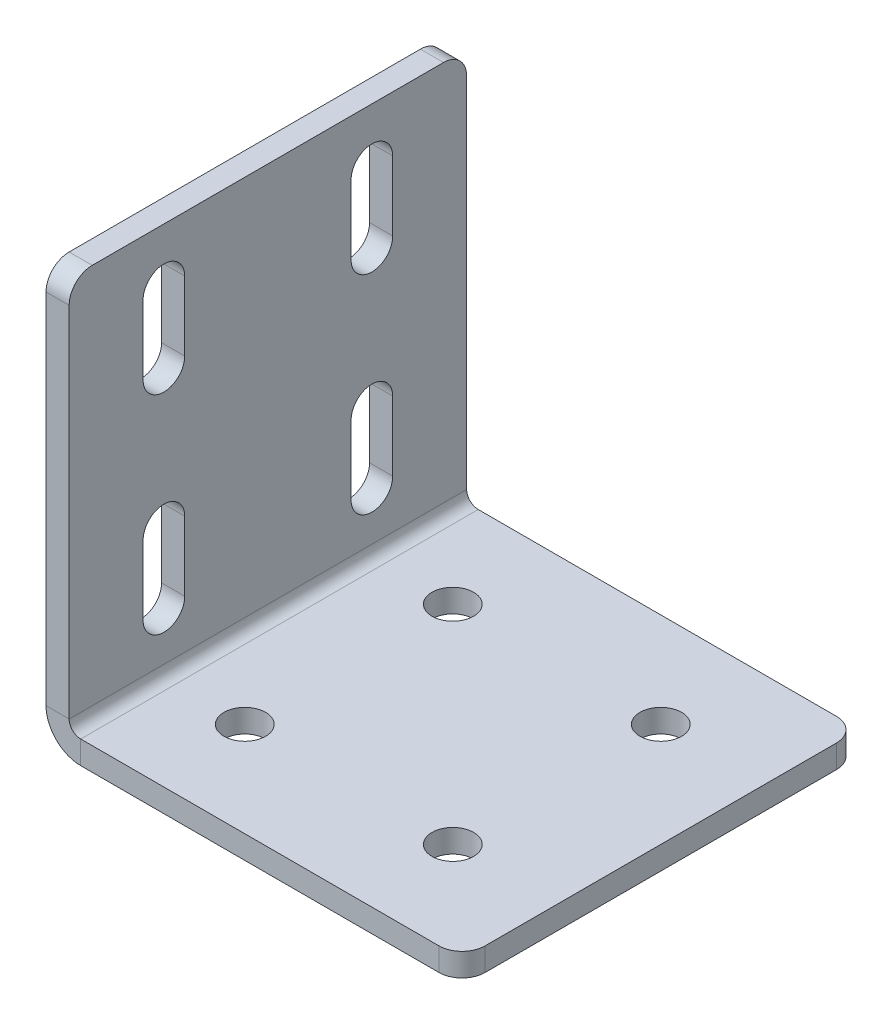
ISO-10303-21;
HEADER;
FILE_DESCRIPTION(('STEP AP214'),'2;1');
FILE_NAME('part.step','',(''),(''),'','','');
FILE_SCHEMA(('AUTOMOTIVE_DESIGN { 1 0 10303 214 1 1 1 1 }'));
ENDSEC;
DATA;
#1=APPLICATION_CONTEXT('core data for automotive mechanical design processes');
#2=APPLICATION_PROTOCOL_DEFINITION('international standard','automotive_design',2000,#1);
#3=PRODUCT_CONTEXT('',#1,'mechanical');
#4=PRODUCT('Part','Part','',(#3));
#5=PRODUCT_RELATED_PRODUCT_CATEGORY('part','',(#4));
#6=PRODUCT_DEFINITION_FORMATION('','',#4);
#7=PRODUCT_DEFINITION_CONTEXT('part definition',#1,'design');
#8=PRODUCT_DEFINITION('design','',#6,#7);
#9=PRODUCT_DEFINITION_SHAPE('','',#8);
#10=(LENGTH_UNIT() NAMED_UNIT(*) SI_UNIT(.MILLI.,.METRE.));
#11=(NAMED_UNIT(*) PLANE_ANGLE_UNIT() SI_UNIT($,.RADIAN.));
#12=(NAMED_UNIT(*) SI_UNIT($,.STERADIAN.) SOLID_ANGLE_UNIT());
#13=UNCERTAINTY_MEASURE_WITH_UNIT(LENGTH_MEASURE(1.E-05),#10,'distance_accuracy_value','');
#14=(GEOMETRIC_REPRESENTATION_CONTEXT(3) GLOBAL_UNCERTAINTY_ASSIGNED_CONTEXT((#13)) GLOBAL_UNIT_ASSIGNED_CONTEXT((#10,
#11,#12)) REPRESENTATION_CONTEXT('',''));
#15=CARTESIAN_POINT('',(0.,0.,0.));
#16=DIRECTION('',(0.,0.,1.));
#17=DIRECTION('',(1.,0.,0.));
#18=AXIS2_PLACEMENT_3D('',#15,#16,#17);
#19=CARTESIAN_POINT('',(0.,63.,-22.5));
#20=DIRECTION('',(-1.,0.,0.));
#21=DIRECTION('',(0.,0.,1.));
#22=AXIS2_PLACEMENT_3D('',#19,#20,#21);
#23=CYLINDRICAL_SURFACE('',#22,4.5);
#24=CARTESIAN_POINT('',(4.99999999999999,63.,-22.5));
#25=DIRECTION('',(1.,0.,0.));
#26=DIRECTION('',(0.,0.,-1.));
#27=AXIS2_PLACEMENT_3D('',#24,#25,#26);
#28=CIRCLE('',#27,4.5);
#29=CARTESIAN_POINT('',(5.,63.,-18.));
#30=VERTEX_POINT('',#29);
#31=CARTESIAN_POINT('',(5.,63.,-27.));
#32=VERTEX_POINT('',#31);
#33=EDGE_CURVE('E497',#30,#32,#28,.T.);
#34=ORIENTED_EDGE('',*,*,#33,.T.);
#35=DIRECTION('',(1.,0.,0.));
#36=VECTOR('',#35,1.);
#37=CARTESIAN_POINT('',(0.,63.,-27.));
#38=LINE('',#37,#36);
#39=CARTESIAN_POINT('',(0.,63.,-27.));
#40=VERTEX_POINT('',#39);
#41=EDGE_CURVE('E276',#40,#32,#38,.T.);
#42=ORIENTED_EDGE('',*,*,#41,.F.);
#43=CARTESIAN_POINT('',(0.,63.,-22.5));
#44=DIRECTION('',(1.,0.,0.));
#45=DIRECTION('',(0.,0.,-1.));
#46=AXIS2_PLACEMENT_3D('',#43,#44,#45);
#47=CIRCLE('',#46,4.5);
#48=CARTESIAN_POINT('',(0.,63.,-18.));
#49=VERTEX_POINT('',#48);
#50=EDGE_CURVE('E386',#49,#40,#47,.T.);
#51=ORIENTED_EDGE('',*,*,#50,.F.);
#52=DIRECTION('',(1.,0.,0.));
#53=VECTOR('',#52,1.);
#54=CARTESIAN_POINT('',(0.,63.,-18.));
#55=LINE('',#54,#53);
#56=EDGE_CURVE('E243',#49,#30,#55,.T.);
#57=ORIENTED_EDGE('',*,*,#56,.T.);
#58=EDGE_LOOP('',(#34,#42,#51,#57));
#59=FACE_BOUND('',#58,.T.);
#60=ADVANCED_FACE('F46',(#59),#23,.F.);
#61=CARTESIAN_POINT('',(0.,18.,22.5));
#62=DIRECTION('',(-1.,0.,0.));
#63=DIRECTION('',(0.,0.,1.));
#64=AXIS2_PLACEMENT_3D('',#61,#62,#63);
#65=CYLINDRICAL_SURFACE('',#64,4.5);
#66=CARTESIAN_POINT('',(5.,18.,22.5));
#67=DIRECTION('',(1.,0.,0.));
#68=DIRECTION('',(0.,0.,-1.));
#69=AXIS2_PLACEMENT_3D('',#66,#67,#68);
#70=CIRCLE('',#69,4.5);
#71=CARTESIAN_POINT('',(5.,18.,27.));
#72=VERTEX_POINT('',#71);
#73=CARTESIAN_POINT('',(5.,18.,18.));
#74=VERTEX_POINT('',#73);
#75=EDGE_CURVE('E514',#72,#74,#70,.T.);
#76=ORIENTED_EDGE('',*,*,#75,.T.);
#77=DIRECTION('',(1.,0.,0.));
#78=VECTOR('',#77,1.);
#79=CARTESIAN_POINT('',(0.,18.,18.));
#80=LINE('',#79,#78);
#81=CARTESIAN_POINT('',(0.,18.,18.));
#82=VERTEX_POINT('',#81);
#83=EDGE_CURVE('E376',#82,#74,#80,.T.);
#84=ORIENTED_EDGE('',*,*,#83,.F.);
#85=CARTESIAN_POINT('',(0.,18.,22.5));
#86=DIRECTION('',(1.,0.,0.));
#87=DIRECTION('',(0.,0.,-1.));
#88=AXIS2_PLACEMENT_3D('',#85,#86,#87);
#89=CIRCLE('',#88,4.5);
#90=CARTESIAN_POINT('',(0.,18.,27.));
#91=VERTEX_POINT('',#90);
#92=EDGE_CURVE('E389',#91,#82,#89,.T.);
#93=ORIENTED_EDGE('',*,*,#92,.F.);
#94=DIRECTION('',(1.,0.,0.));
#95=VECTOR('',#94,1.);
#96=CARTESIAN_POINT('',(0.,18.,27.));
#97=LINE('',#96,#95);
#98=EDGE_CURVE('E379',#91,#72,#97,.T.);
#99=ORIENTED_EDGE('',*,*,#98,.T.);
#100=EDGE_LOOP('',(#76,#84,#93,#99));
#101=FACE_BOUND('',#100,.T.);
#102=ADVANCED_FACE('F661',(#101),#65,.F.);
#103=CARTESIAN_POINT('',(0.,63.,22.5));
#104=DIRECTION('',(-1.,0.,0.));
#105=DIRECTION('',(0.,0.,1.));
#106=AXIS2_PLACEMENT_3D('',#103,#104,#105);
#107=CYLINDRICAL_SURFACE('',#106,4.5);
#108=CARTESIAN_POINT('',(4.99999999999999,63.,22.5));
#109=DIRECTION('',(1.,0.,0.));
#110=DIRECTION('',(0.,0.,-1.));
#111=AXIS2_PLACEMENT_3D('',#108,#109,#110);
#112=CIRCLE('',#111,4.5);
#113=CARTESIAN_POINT('',(5.,63.,27.));
#114=VERTEX_POINT('',#113);
#115=CARTESIAN_POINT('',(5.,63.,18.));
#116=VERTEX_POINT('',#115);
#117=EDGE_CURVE('E518',#114,#116,#112,.T.);
#118=ORIENTED_EDGE('',*,*,#117,.T.);
#119=DIRECTION('',(1.,0.,0.));
#120=VECTOR('',#119,1.);
#121=CARTESIAN_POINT('',(0.,63.,18.));
#122=LINE('',#121,#120);
#123=CARTESIAN_POINT('',(0.,63.,18.));
#124=VERTEX_POINT('',#123);
#125=EDGE_CURVE('E308',#124,#116,#122,.T.);
#126=ORIENTED_EDGE('',*,*,#125,.F.);
#127=CARTESIAN_POINT('',(0.,63.,22.5));
#128=DIRECTION('',(1.,0.,0.));
#129=DIRECTION('',(0.,0.,-1.));
#130=AXIS2_PLACEMENT_3D('',#127,#128,#129);
#131=CIRCLE('',#130,4.5);
#132=CARTESIAN_POINT('',(0.,63.,27.));
#133=VERTEX_POINT('',#132);
#134=EDGE_CURVE('E394',#133,#124,#131,.T.);
#135=ORIENTED_EDGE('',*,*,#134,.F.);
#136=DIRECTION('',(1.,0.,0.));
#137=VECTOR('',#136,1.);
#138=CARTESIAN_POINT('',(0.,63.,27.));
#139=LINE('',#138,#137);
#140=EDGE_CURVE('E311',#133,#114,#139,.T.);
#141=ORIENTED_EDGE('',*,*,#140,.T.);
#142=EDGE_LOOP('',(#118,#126,#135,#141));
#143=FACE_BOUND('',#142,.T.);
#144=ADVANCED_FACE('F667',(#143),#107,.F.);
#145=CARTESIAN_POINT('',(0.,18.,-22.5));
#146=DIRECTION('',(-1.,0.,0.));
#147=DIRECTION('',(0.,0.,1.));
#148=AXIS2_PLACEMENT_3D('',#145,#146,#147);
#149=CYLINDRICAL_SURFACE('',#148,4.5);
#150=CARTESIAN_POINT('',(5.,18.,-22.5));
#151=DIRECTION('',(1.,0.,0.));
#152=DIRECTION('',(0.,0.,-1.));
#153=AXIS2_PLACEMENT_3D('',#150,#151,#152);
#154=CIRCLE('',#153,4.5);
#155=CARTESIAN_POINT('',(5.,18.,-18.));
#156=VERTEX_POINT('',#155);
#157=CARTESIAN_POINT('',(5.,18.,-27.));
#158=VERTEX_POINT('',#157);
#159=EDGE_CURVE('E507',#156,#158,#154,.T.);
#160=ORIENTED_EDGE('',*,*,#159,.T.);
#161=DIRECTION('',(1.,0.,0.));
#162=VECTOR('',#161,1.);
#163=CARTESIAN_POINT('',(0.,18.,-27.));
#164=LINE('',#163,#162);
#165=CARTESIAN_POINT('',(0.,18.,-27.));
#166=VERTEX_POINT('',#165);
#167=EDGE_CURVE('E341',#166,#158,#164,.T.);
#168=ORIENTED_EDGE('',*,*,#167,.F.);
#169=CARTESIAN_POINT('',(0.,18.,-22.5));
#170=DIRECTION('',(1.,0.,0.));
#171=DIRECTION('',(0.,0.,-1.));
#172=AXIS2_PLACEMENT_3D('',#169,#170,#171);
#173=CIRCLE('',#172,4.5);
#174=CARTESIAN_POINT('',(0.,18.,-18.));
#175=VERTEX_POINT('',#174);
#176=EDGE_CURVE('E398',#175,#166,#173,.T.);
#177=ORIENTED_EDGE('',*,*,#176,.F.);
#178=DIRECTION('',(1.,0.,0.));
#179=VECTOR('',#178,1.);
#180=CARTESIAN_POINT('',(0.,18.,-18.));
#181=LINE('',#180,#179);
#182=EDGE_CURVE('E344',#175,#156,#181,.T.);
#183=ORIENTED_EDGE('',*,*,#182,.T.);
#184=EDGE_LOOP('',(#160,#168,#177,#183));
#185=FACE_BOUND('',#184,.T.);
#186=ADVANCED_FACE('F675',(#185),#149,.F.);
#187=CARTESIAN_POINT('',(0.,0.,43.));
#188=DIRECTION('',(0.,0.,-1.));
#189=DIRECTION('',(0.,-1.,0.));
#190=AXIS2_PLACEMENT_3D('',#187,#188,#189);
#191=PLANE('',#190);
#192=DIRECTION('',(0.,1.,0.));
#193=VECTOR('',#192,1.);
#194=CARTESIAN_POINT('',(5.,0.,43.));
#195=LINE('',#194,#193);
#196=CARTESIAN_POINT('',(5.,85.,43.));
#197=VERTEX_POINT('',#196);
#198=CARTESIAN_POINT('',(5.,7.5,43.));
#199=VERTEX_POINT('',#198);
#200=EDGE_CURVE('E504',#197,#199,#195,.F.);
#201=ORIENTED_EDGE('',*,*,#200,.F.);
#202=DIRECTION('',(1.,0.,0.));
#203=VECTOR('',#202,1.);
#204=CARTESIAN_POINT('',(0.,85.,43.));
#205=LINE('',#204,#203);
#206=CARTESIAN_POINT('',(0.,85.,43.));
#207=VERTEX_POINT('',#206);
#208=EDGE_CURVE('E11',#197,#207,#205,.F.);
#209=ORIENTED_EDGE('',*,*,#208,.T.);
#210=DIRECTION('',(0.,-1.,0.));
#211=VECTOR('',#210,1.);
#212=CARTESIAN_POINT('',(0.,0.,43.));
#213=LINE('',#212,#211);
#214=CARTESIAN_POINT('',(0.,7.5,43.));
#215=VERTEX_POINT('',#214);
#216=EDGE_CURVE('E402',#207,#215,#213,.T.);
#217=ORIENTED_EDGE('',*,*,#216,.T.);
#218=DIRECTION('',(-1.,0.,0.));
#219=VECTOR('',#218,1.);
#220=CARTESIAN_POINT('',(0.,7.5,43.));
#221=LINE('',#220,#219);
#222=EDGE_CURVE('E532',#199,#215,#221,.T.);
#223=ORIENTED_EDGE('',*,*,#222,.F.);
#224=EDGE_LOOP('',(#201,#209,#217,#223));
#225=FACE_BOUND('',#224,.T.);
#226=ADVANCED_FACE('F618',(#225),#191,.F.);
#227=CARTESIAN_POINT('',(0.,90.,-43.));
#228=DIRECTION('',(0.,-1.,0.));
#229=DIRECTION('',(0.,0.,1.));
#230=AXIS2_PLACEMENT_3D('',#227,#228,#229);
#231=PLANE('',#230);
#232=DIRECTION('',(0.,0.,1.));
#233=VECTOR('',#232,1.);
#234=CARTESIAN_POINT('',(5.,90.,-43.));
#235=LINE('',#234,#233);
#236=CARTESIAN_POINT('',(5.,90.,-38.));
#237=VERTEX_POINT('',#236);
#238=CARTESIAN_POINT('',(5.,90.,38.));
#239=VERTEX_POINT('',#238);
#240=EDGE_CURVE('E500',#237,#239,#235,.T.);
#241=ORIENTED_EDGE('',*,*,#240,.F.);
#242=DIRECTION('',(-1.,0.,0.));
#243=VECTOR('',#242,1.);
#244=CARTESIAN_POINT('',(0.,90.,-38.));
#245=LINE('',#244,#243);
#246=CARTESIAN_POINT('',(0.,90.,-38.));
#247=VERTEX_POINT('',#246);
#248=EDGE_CURVE('E567',#237,#247,#245,.T.);
#249=ORIENTED_EDGE('',*,*,#248,.T.);
#250=DIRECTION('',(0.,0.,1.));
#251=VECTOR('',#250,1.);
#252=CARTESIAN_POINT('',(0.,90.,-43.));
#253=LINE('',#252,#251);
#254=CARTESIAN_POINT('',(0.,90.,38.));
#255=VERTEX_POINT('',#254);
#256=EDGE_CURVE('E405',#247,#255,#253,.T.);
#257=ORIENTED_EDGE('',*,*,#256,.T.);
#258=DIRECTION('',(1.,0.,0.));
#259=VECTOR('',#258,1.);
#260=CARTESIAN_POINT('',(0.,90.,38.));
#261=LINE('',#260,#259);
#262=EDGE_CURVE('E564',#255,#239,#261,.T.);
#263=ORIENTED_EDGE('',*,*,#262,.T.);
#264=EDGE_LOOP('',(#241,#249,#257,#263));
#265=FACE_BOUND('',#264,.T.);
#266=ADVANCED_FACE('F596',(#265),#231,.F.);
#267=CARTESIAN_POINT('',(0.,0.,-43.));
#268=DIRECTION('',(0.,0.,-1.));
#269=DIRECTION('',(0.,-1.,0.));
#270=AXIS2_PLACEMENT_3D('',#267,#268,#269);
#271=PLANE('',#270);
#272=DIRECTION('',(0.,-1.,0.));
#273=VECTOR('',#272,1.);
#274=CARTESIAN_POINT('',(0.,0.,-43.));
#275=LINE('',#274,#273);
#276=CARTESIAN_POINT('',(0.,85.,-43.));
#277=VERTEX_POINT('',#276);
#278=CARTESIAN_POINT('',(0.,7.5,-43.));
#279=VERTEX_POINT('',#278);
#280=EDGE_CURVE('E409',#277,#279,#275,.T.);
#281=ORIENTED_EDGE('',*,*,#280,.F.);
#282=DIRECTION('',(1.,0.,0.));
#283=VECTOR('',#282,1.);
#284=CARTESIAN_POINT('',(0.,85.,-43.));
#285=LINE('',#284,#283);
#286=CARTESIAN_POINT('',(5.,85.,-43.));
#287=VERTEX_POINT('',#286);
#288=EDGE_CURVE('E577',#277,#287,#285,.T.);
#289=ORIENTED_EDGE('',*,*,#288,.T.);
#290=DIRECTION('',(0.,1.,0.));
#291=VECTOR('',#290,1.);
#292=CARTESIAN_POINT('',(5.,0.,-43.));
#293=LINE('',#292,#291);
#294=CARTESIAN_POINT('',(5.,7.5,-43.));
#295=VERTEX_POINT('',#294);
#296=EDGE_CURVE('E470',#287,#295,#293,.F.);
#297=ORIENTED_EDGE('',*,*,#296,.T.);
#298=DIRECTION('',(-1.,0.,0.));
#299=VECTOR('',#298,1.);
#300=CARTESIAN_POINT('',(0.,7.5,-43.));
#301=LINE('',#300,#299);
#302=EDGE_CURVE('E528',#295,#279,#301,.T.);
#303=ORIENTED_EDGE('',*,*,#302,.T.);
#304=EDGE_LOOP('',(#281,#289,#297,#303));
#305=FACE_BOUND('',#304,.T.);
#306=ADVANCED_FACE('F603',(#305),#271,.T.);
#307=CARTESIAN_POINT('',(7.5,7.5,-43.));
#308=DIRECTION('',(0.,0.,1.));
#309=DIRECTION('',(1.,0.,0.));
#310=AXIS2_PLACEMENT_3D('',#307,#308,#309);
#311=PLANE('',#310);
#312=ORIENTED_EDGE('',*,*,#302,.F.);
#313=CARTESIAN_POINT('',(7.5,7.5,-43.));
#314=DIRECTION('',(0.,0.,1.));
#315=DIRECTION('',(1.,0.,0.));
#316=AXIS2_PLACEMENT_3D('',#313,#314,#315);
#317=CIRCLE('',#316,2.5);
#318=CARTESIAN_POINT('',(7.50000000000001,5.,-43.));
#319=VERTEX_POINT('',#318);
#320=EDGE_CURVE('E493',#295,#319,#317,.T.);
#321=ORIENTED_EDGE('',*,*,#320,.T.);
#322=DIRECTION('',(0.,-1.,0.));
#323=VECTOR('',#322,1.);
#324=CARTESIAN_POINT('',(7.50000000000003,0.,-43.));
#325=LINE('',#324,#323);
#326=CARTESIAN_POINT('',(7.50000000000003,0.,-43.));
#327=VERTEX_POINT('',#326);
#328=EDGE_CURVE('E525',#319,#327,#325,.T.);
#329=ORIENTED_EDGE('',*,*,#328,.T.);
#330=CARTESIAN_POINT('',(7.5,7.5,-43.));
#331=DIRECTION('',(0.,0.,-1.));
#332=DIRECTION('',(-1.,0.,0.));
#333=AXIS2_PLACEMENT_3D('',#330,#331,#332);
#334=CIRCLE('',#333,7.5);
#335=EDGE_CURVE('E390',#279,#327,#334,.F.);
#336=ORIENTED_EDGE('',*,*,#335,.F.);
#337=EDGE_LOOP('',(#312,#321,#329,#336));
#338=FACE_BOUND('',#337,.T.);
#339=ADVANCED_FACE('F608',(#338),#311,.F.);
#340=CARTESIAN_POINT('',(90.,0.,-43.));
#341=DIRECTION('',(0.,0.,-1.));
#342=DIRECTION('',(1.,0.,0.));
#343=AXIS2_PLACEMENT_3D('',#340,#341,#342);
#344=PLANE('',#343);
#345=DIRECTION('',(1.,0.,0.));
#346=VECTOR('',#345,1.);
#347=CARTESIAN_POINT('',(90.,5.,-43.));
#348=LINE('',#347,#346);
#349=CARTESIAN_POINT('',(85.,5.,-43.));
#350=VERTEX_POINT('',#349);
#351=EDGE_CURVE('E464',#319,#350,#348,.T.);
#352=ORIENTED_EDGE('',*,*,#351,.T.);
#353=DIRECTION('',(0.,-1.,0.));
#354=VECTOR('',#353,1.);
#355=CARTESIAN_POINT('',(85.,0.,-43.));
#356=LINE('',#355,#354);
#357=CARTESIAN_POINT('',(85.,0.,-43.));
#358=VERTEX_POINT('',#357);
#359=EDGE_CURVE('E536',#350,#358,#356,.T.);
#360=ORIENTED_EDGE('',*,*,#359,.T.);
#361=DIRECTION('',(1.,0.,0.));
#362=VECTOR('',#361,1.);
#363=CARTESIAN_POINT('',(90.,0.,-43.));
#364=LINE('',#363,#362);
#365=EDGE_CURVE('E436',#327,#358,#364,.T.);
#366=ORIENTED_EDGE('',*,*,#365,.F.);
#367=ORIENTED_EDGE('',*,*,#328,.F.);
#368=EDGE_LOOP('',(#352,#360,#366,#367));
#369=FACE_BOUND('',#368,.T.);
#370=ADVANCED_FACE('F651',(#369),#344,.T.);
#371=CARTESIAN_POINT('',(90.,0.,-43.));
#372=DIRECTION('',(1.,0.,0.));
#373=DIRECTION('',(0.,0.,1.));
#374=AXIS2_PLACEMENT_3D('',#371,#372,#373);
#375=PLANE('',#374);
#376=DIRECTION('',(0.,0.,1.));
#377=VECTOR('',#376,1.);
#378=CARTESIAN_POINT('',(90.,0.,-43.));
#379=LINE('',#378,#377);
#380=CARTESIAN_POINT('',(90.,0.,-38.));
#381=VERTEX_POINT('',#380);
#382=CARTESIAN_POINT('',(90.,0.,38.));
#383=VERTEX_POINT('',#382);
#384=EDGE_CURVE('E428',#381,#383,#379,.T.);
#385=ORIENTED_EDGE('',*,*,#384,.F.);
#386=DIRECTION('',(0.,-1.,0.));
#387=VECTOR('',#386,1.);
#388=CARTESIAN_POINT('',(90.,0.,-38.));
#389=LINE('',#388,#387);
#390=CARTESIAN_POINT('',(90.,5.,-38.));
#391=VERTEX_POINT('',#390);
#392=EDGE_CURVE('E552',#381,#391,#389,.F.);
#393=ORIENTED_EDGE('',*,*,#392,.T.);
#394=DIRECTION('',(0.,0.,1.));
#395=VECTOR('',#394,1.);
#396=CARTESIAN_POINT('',(90.,5.,-43.));
#397=LINE('',#396,#395);
#398=CARTESIAN_POINT('',(90.,5.,38.));
#399=VERTEX_POINT('',#398);
#400=EDGE_CURVE('E482',#391,#399,#397,.T.);
#401=ORIENTED_EDGE('',*,*,#400,.T.);
#402=DIRECTION('',(0.,1.,0.));
#403=VECTOR('',#402,1.);
#404=CARTESIAN_POINT('',(90.,0.,38.));
#405=LINE('',#404,#403);
#406=EDGE_CURVE('E548',#399,#383,#405,.F.);
#407=ORIENTED_EDGE('',*,*,#406,.T.);
#408=EDGE_LOOP('',(#385,#393,#401,#407));
#409=FACE_BOUND('',#408,.T.);
#410=ADVANCED_FACE('F642',(#409),#375,.T.);
#411=CARTESIAN_POINT('',(90.,0.,43.));
#412=DIRECTION('',(0.,0.,-1.));
#413=DIRECTION('',(1.,0.,0.));
#414=AXIS2_PLACEMENT_3D('',#411,#412,#413);
#415=PLANE('',#414);
#416=DIRECTION('',(1.,0.,0.));
#417=VECTOR('',#416,1.);
#418=CARTESIAN_POINT('',(90.,0.,43.));
#419=LINE('',#418,#417);
#420=CARTESIAN_POINT('',(7.50000000000003,0.,43.));
#421=VERTEX_POINT('',#420);
#422=CARTESIAN_POINT('',(85.,0.,43.));
#423=VERTEX_POINT('',#422);
#424=EDGE_CURVE('E432',#421,#423,#419,.T.);
#425=ORIENTED_EDGE('',*,*,#424,.T.);
#426=DIRECTION('',(0.,-1.,0.));
#427=VECTOR('',#426,1.);
#428=CARTESIAN_POINT('',(85.,0.,43.));
#429=LINE('',#428,#427);
#430=CARTESIAN_POINT('',(85.,5.,43.));
#431=VERTEX_POINT('',#430);
#432=EDGE_CURVE('E561',#423,#431,#429,.F.);
#433=ORIENTED_EDGE('',*,*,#432,.T.);
#434=DIRECTION('',(1.,0.,0.));
#435=VECTOR('',#434,1.);
#436=CARTESIAN_POINT('',(90.,5.,43.));
#437=LINE('',#436,#435);
#438=CARTESIAN_POINT('',(7.50000000000003,5.,43.));
#439=VERTEX_POINT('',#438);
#440=EDGE_CURVE('E483',#439,#431,#437,.T.);
#441=ORIENTED_EDGE('',*,*,#440,.F.);
#442=DIRECTION('',(0.,-1.,0.));
#443=VECTOR('',#442,1.);
#444=CARTESIAN_POINT('',(7.50000000000003,0.,43.));
#445=LINE('',#444,#443);
#446=EDGE_CURVE('E448',#439,#421,#445,.T.);
#447=ORIENTED_EDGE('',*,*,#446,.T.);
#448=EDGE_LOOP('',(#425,#433,#441,#447));
#449=FACE_BOUND('',#448,.T.);
#450=ADVANCED_FACE('F629',(#449),#415,.F.);
#451=CARTESIAN_POINT('',(22.5,0.,-22.5));
#452=DIRECTION('',(0.,-1.,0.));
#453=DIRECTION('',(1.,0.,0.));
#454=AXIS2_PLACEMENT_3D('',#451,#452,#453);
#455=CYLINDRICAL_SURFACE('',#454,4.49999999999999);
#456=CARTESIAN_POINT('',(22.5,0.,-22.5));
#457=DIRECTION('',(0.,-1.,0.));
#458=DIRECTION('',(0.,0.,-1.));
#459=AXIS2_PLACEMENT_3D('',#456,#457,#458);
#460=CIRCLE('',#459,4.49999999999999);
#461=CARTESIAN_POINT('',(22.5,0.,-27.));
#462=VERTEX_POINT('',#461);
#463=EDGE_CURVE('E412',#462,#462,#460,.T.);
#464=ORIENTED_EDGE('',*,*,#463,.T.);
#465=EDGE_LOOP('',(#464));
#466=FACE_BOUND('',#465,.T.);
#467=CARTESIAN_POINT('',(22.5,5.,-22.5));
#468=DIRECTION('',(0.,-1.,0.));
#469=DIRECTION('',(0.,0.,-1.));
#470=AXIS2_PLACEMENT_3D('',#467,#468,#469);
#471=CIRCLE('',#470,4.49999999999999);
#472=CARTESIAN_POINT('',(22.5,5.,-27.));
#473=VERTEX_POINT('',#472);
#474=EDGE_CURVE('E465',#473,#473,#471,.T.);
#475=ORIENTED_EDGE('',*,*,#474,.F.);
#476=EDGE_LOOP('',(#475));
#477=FACE_BOUND('',#476,.T.);
#478=ADVANCED_FACE('F719',(#466,#477),#455,.F.);
#479=CARTESIAN_POINT('',(67.5,0.,22.5));
#480=DIRECTION('',(0.,-1.,0.));
#481=DIRECTION('',(1.,0.,0.));
#482=AXIS2_PLACEMENT_3D('',#479,#480,#481);
#483=CYLINDRICAL_SURFACE('',#482,4.49999999999999);
#484=CARTESIAN_POINT('',(67.5,0.,22.5));
#485=DIRECTION('',(0.,-1.,0.));
#486=DIRECTION('',(0.,0.,-1.));
#487=AXIS2_PLACEMENT_3D('',#484,#485,#486);
#488=CIRCLE('',#487,4.49999999999999);
#489=CARTESIAN_POINT('',(67.5,0.,18.));
#490=VERTEX_POINT('',#489);
#491=EDGE_CURVE('E416',#490,#490,#488,.T.);
#492=ORIENTED_EDGE('',*,*,#491,.T.);
#493=EDGE_LOOP('',(#492));
#494=FACE_BOUND('',#493,.T.);
#495=CARTESIAN_POINT('',(67.5,5.,22.5));
#496=DIRECTION('',(0.,-1.,0.));
#497=DIRECTION('',(0.,0.,-1.));
#498=AXIS2_PLACEMENT_3D('',#495,#496,#497);
#499=CIRCLE('',#498,4.49999999999999);
#500=CARTESIAN_POINT('',(67.5,5.,18.));
#501=VERTEX_POINT('',#500);
#502=EDGE_CURVE('E469',#501,#501,#499,.T.);
#503=ORIENTED_EDGE('',*,*,#502,.F.);
#504=EDGE_LOOP('',(#503));
#505=FACE_BOUND('',#504,.T.);
#506=ADVANCED_FACE('F722',(#494,#505),#483,.F.);
#507=CARTESIAN_POINT('',(67.5,0.,-22.5));
#508=DIRECTION('',(0.,-1.,0.));
#509=DIRECTION('',(1.,0.,0.));
#510=AXIS2_PLACEMENT_3D('',#507,#508,#509);
#511=CYLINDRICAL_SURFACE('',#510,4.49999999999999);
#512=CARTESIAN_POINT('',(67.5,0.,-22.5));
#513=DIRECTION('',(0.,-1.,0.));
#514=DIRECTION('',(0.,0.,-1.));
#515=AXIS2_PLACEMENT_3D('',#512,#513,#514);
#516=CIRCLE('',#515,4.49999999999999);
#517=CARTESIAN_POINT('',(67.5,0.,-27.));
#518=VERTEX_POINT('',#517);
#519=EDGE_CURVE('E420',#518,#518,#516,.T.);
#520=ORIENTED_EDGE('',*,*,#519,.T.);
#521=EDGE_LOOP('',(#520));
#522=FACE_BOUND('',#521,.T.);
#523=CARTESIAN_POINT('',(67.5,5.,-22.5));
#524=DIRECTION('',(0.,-1.,0.));
#525=DIRECTION('',(0.,0.,-1.));
#526=AXIS2_PLACEMENT_3D('',#523,#524,#525);
#527=CIRCLE('',#526,4.49999999999999);
#528=CARTESIAN_POINT('',(67.5,5.,-27.));
#529=VERTEX_POINT('',#528);
#530=EDGE_CURVE('E474',#529,#529,#527,.T.);
#531=ORIENTED_EDGE('',*,*,#530,.F.);
#532=EDGE_LOOP('',(#531));
#533=FACE_BOUND('',#532,.T.);
#534=ADVANCED_FACE('F726',(#522,#533),#511,.F.);
#535=CARTESIAN_POINT('',(22.5,0.,22.5));
#536=DIRECTION('',(0.,-1.,0.));
#537=DIRECTION('',(1.,0.,0.));
#538=AXIS2_PLACEMENT_3D('',#535,#536,#537);
#539=CYLINDRICAL_SURFACE('',#538,4.49999999999999);
#540=CARTESIAN_POINT('',(22.5,0.,22.5));
#541=DIRECTION('',(0.,-1.,0.));
#542=DIRECTION('',(0.,0.,-1.));
#543=AXIS2_PLACEMENT_3D('',#540,#541,#542);
#544=CIRCLE('',#543,4.49999999999999);
#545=CARTESIAN_POINT('',(22.5,0.,18.));
#546=VERTEX_POINT('',#545);
#547=EDGE_CURVE('E424',#546,#546,#544,.T.);
#548=ORIENTED_EDGE('',*,*,#547,.T.);
#549=EDGE_LOOP('',(#548));
#550=FACE_BOUND('',#549,.T.);
#551=CARTESIAN_POINT('',(22.5,5.,22.5));
#552=DIRECTION('',(0.,-1.,0.));
#553=DIRECTION('',(0.,0.,-1.));
#554=AXIS2_PLACEMENT_3D('',#551,#552,#553);
#555=CIRCLE('',#554,4.49999999999999);
#556=CARTESIAN_POINT('',(22.5,5.,18.));
#557=VERTEX_POINT('',#556);
#558=EDGE_CURVE('E478',#557,#557,#555,.T.);
#559=ORIENTED_EDGE('',*,*,#558,.F.);
#560=EDGE_LOOP('',(#559));
#561=FACE_BOUND('',#560,.T.);
#562=ADVANCED_FACE('F730',(#550,#561),#539,.F.);
#563=CARTESIAN_POINT('',(7.5,7.5,43.));
#564=DIRECTION('',(0.,0.,-1.));
#565=DIRECTION('',(-1.,0.,0.));
#566=AXIS2_PLACEMENT_3D('',#563,#564,#565);
#567=PLANE('',#566);
#568=CARTESIAN_POINT('',(7.5,7.5,43.));
#569=DIRECTION('',(0.,0.,1.));
#570=DIRECTION('',(1.,0.,0.));
#571=AXIS2_PLACEMENT_3D('',#568,#569,#570);
#572=CIRCLE('',#571,2.5);
#573=EDGE_CURVE('E375',#439,#199,#572,.F.);
#574=ORIENTED_EDGE('',*,*,#573,.T.);
#575=ORIENTED_EDGE('',*,*,#222,.T.);
#576=CARTESIAN_POINT('',(7.5,7.5,43.));
#577=DIRECTION('',(0.,0.,1.));
#578=DIRECTION('',(1.,0.,0.));
#579=AXIS2_PLACEMENT_3D('',#576,#577,#578);
#580=CIRCLE('',#579,7.5);
#581=EDGE_CURVE('E449',#421,#215,#580,.F.);
#582=ORIENTED_EDGE('',*,*,#581,.F.);
#583=ORIENTED_EDGE('',*,*,#446,.F.);
#584=EDGE_LOOP('',(#574,#575,#582,#583));
#585=FACE_BOUND('',#584,.T.);
#586=ADVANCED_FACE('F621',(#585),#567,.F.);
#587=CARTESIAN_POINT('',(90.,0.,-43.));
#588=DIRECTION('',(0.,-1.,0.));
#589=DIRECTION('',(1.,0.,0.));
#590=AXIS2_PLACEMENT_3D('',#587,#588,#589);
#591=PLANE('',#590);
#592=ORIENTED_EDGE('',*,*,#463,.F.);
#593=EDGE_LOOP('',(#592));
#594=FACE_BOUND('',#593,.T.);
#595=ORIENTED_EDGE('',*,*,#491,.F.);
#596=EDGE_LOOP('',(#595));
#597=FACE_BOUND('',#596,.T.);
#598=ORIENTED_EDGE('',*,*,#519,.F.);
#599=EDGE_LOOP('',(#598));
#600=FACE_BOUND('',#599,.T.);
#601=ORIENTED_EDGE('',*,*,#547,.F.);
#602=EDGE_LOOP('',(#601));
#603=FACE_BOUND('',#602,.T.);
#604=ORIENTED_EDGE('',*,*,#365,.T.);
#605=CARTESIAN_POINT('',(85.,0.,-38.));
#606=DIRECTION('',(0.,-1.,0.));
#607=DIRECTION('',(1.,0.,0.));
#608=AXIS2_PLACEMENT_3D('',#605,#606,#607);
#609=CIRCLE('',#608,5.);
#610=EDGE_CURVE('E545',#358,#381,#609,.T.);
#611=ORIENTED_EDGE('',*,*,#610,.T.);
#612=ORIENTED_EDGE('',*,*,#384,.T.);
#613=CARTESIAN_POINT('',(85.,0.,38.));
#614=DIRECTION('',(0.,-1.,0.));
#615=DIRECTION('',(1.,0.,0.));
#616=AXIS2_PLACEMENT_3D('',#613,#614,#615);
#617=CIRCLE('',#616,5.);
#618=EDGE_CURVE('E542',#383,#423,#617,.T.);
#619=ORIENTED_EDGE('',*,*,#618,.T.);
#620=ORIENTED_EDGE('',*,*,#424,.F.);
#621=DIRECTION('',(0.,0.,1.));
#622=VECTOR('',#621,1.);
#623=CARTESIAN_POINT('',(7.50000000000001,0.,-43.));
#624=LINE('',#623,#622);
#625=EDGE_CURVE('E444',#421,#327,#624,.F.);
#626=ORIENTED_EDGE('',*,*,#625,.T.);
#627=EDGE_LOOP('',(#604,#611,#612,#619,#620,#626));
#628=FACE_BOUND('',#627,.T.);
#629=ADVANCED_FACE('F645',(#594,#597,#600,#603,#628),#591,.T.);
#630=CARTESIAN_POINT('',(0.,0.,-43.));
#631=DIRECTION('',(-1.,0.,0.));
#632=DIRECTION('',(0.,0.,1.));
#633=AXIS2_PLACEMENT_3D('',#630,#631,#632);
#634=PLANE('',#633);
#635=DIRECTION('',(0.,1.,0.));
#636=VECTOR('',#635,1.);
#637=CARTESIAN_POINT('',(0.,78.,18.));
#638=LINE('',#637,#636);
#639=CARTESIAN_POINT('',(0.,78.,18.));
#640=VERTEX_POINT('',#639);
#641=EDGE_CURVE('E290',#124,#640,#638,.T.);
#642=ORIENTED_EDGE('',*,*,#641,.T.);
#643=CARTESIAN_POINT('',(0.,78.,22.5));
#644=DIRECTION('',(1.,0.,0.));
#645=DIRECTION('',(0.,0.,-1.));
#646=AXIS2_PLACEMENT_3D('',#643,#644,#645);
#647=CIRCLE('',#646,4.5);
#648=CARTESIAN_POINT('',(0.,78.,27.));
#649=VERTEX_POINT('',#648);
#650=EDGE_CURVE('E281',#640,#649,#647,.T.);
#651=ORIENTED_EDGE('',*,*,#650,.T.);
#652=DIRECTION('',(0.,-1.,0.));
#653=VECTOR('',#652,1.);
#654=CARTESIAN_POINT('',(0.,78.,27.));
#655=LINE('',#654,#653);
#656=EDGE_CURVE('E285',#649,#133,#655,.T.);
#657=ORIENTED_EDGE('',*,*,#656,.T.);
#658=ORIENTED_EDGE('',*,*,#134,.T.);
#659=EDGE_LOOP('',(#642,#651,#657,#658));
#660=FACE_BOUND('',#659,.T.);
#661=DIRECTION('',(0.,1.,0.));
#662=VECTOR('',#661,1.);
#663=CARTESIAN_POINT('',(0.,33.,-27.));
#664=LINE('',#663,#662);
#665=CARTESIAN_POINT('',(0.,33.,-27.));
#666=VERTEX_POINT('',#665);
#667=EDGE_CURVE('E326',#166,#666,#664,.T.);
#668=ORIENTED_EDGE('',*,*,#667,.T.);
#669=CARTESIAN_POINT('',(0.,33.,-22.5));
#670=DIRECTION('',(1.,0.,0.));
#671=DIRECTION('',(0.,0.,-1.));
#672=AXIS2_PLACEMENT_3D('',#669,#670,#671);
#673=CIRCLE('',#672,4.5);
#674=CARTESIAN_POINT('',(0.,33.,-18.));
#675=VERTEX_POINT('',#674);
#676=EDGE_CURVE('E317',#666,#675,#673,.T.);
#677=ORIENTED_EDGE('',*,*,#676,.T.);
#678=DIRECTION('',(0.,-1.,0.));
#679=VECTOR('',#678,1.);
#680=CARTESIAN_POINT('',(0.,33.,-18.));
#681=LINE('',#680,#679);
#682=EDGE_CURVE('E321',#675,#175,#681,.T.);
#683=ORIENTED_EDGE('',*,*,#682,.T.);
#684=ORIENTED_EDGE('',*,*,#176,.T.);
#685=EDGE_LOOP('',(#668,#677,#683,#684));
#686=FACE_BOUND('',#685,.T.);
#687=DIRECTION('',(0.,1.,0.));
#688=VECTOR('',#687,1.);
#689=CARTESIAN_POINT('',(0.,78.,-27.));
#690=LINE('',#689,#688);
#691=CARTESIAN_POINT('',(0.,78.,-27.));
#692=VERTEX_POINT('',#691);
#693=EDGE_CURVE('E244',#40,#692,#690,.T.);
#694=ORIENTED_EDGE('',*,*,#693,.T.);
#695=CARTESIAN_POINT('',(0.,78.,-22.5));
#696=DIRECTION('',(1.,0.,0.));
#697=DIRECTION('',(0.,0.,-1.));
#698=AXIS2_PLACEMENT_3D('',#695,#696,#697);
#699=CIRCLE('',#698,4.5);
#700=CARTESIAN_POINT('',(0.,78.,-18.));
#701=VERTEX_POINT('',#700);
#702=EDGE_CURVE('E236',#692,#701,#699,.T.);
#703=ORIENTED_EDGE('',*,*,#702,.T.);
#704=DIRECTION('',(0.,-1.,0.));
#705=VECTOR('',#704,1.);
#706=CARTESIAN_POINT('',(0.,78.,-18.));
#707=LINE('',#706,#705);
#708=EDGE_CURVE('E247',#701,#49,#707,.T.);
#709=ORIENTED_EDGE('',*,*,#708,.T.);
#710=ORIENTED_EDGE('',*,*,#50,.T.);
#711=EDGE_LOOP('',(#694,#703,#709,#710));
#712=FACE_BOUND('',#711,.T.);
#713=DIRECTION('',(0.,1.,0.));
#714=VECTOR('',#713,1.);
#715=CARTESIAN_POINT('',(0.,33.,18.));
#716=LINE('',#715,#714);
#717=CARTESIAN_POINT('',(0.,33.,18.));
#718=VERTEX_POINT('',#717);
#719=EDGE_CURVE('E359',#82,#718,#716,.T.);
#720=ORIENTED_EDGE('',*,*,#719,.T.);
#721=CARTESIAN_POINT('',(0.,33.,22.5));
#722=DIRECTION('',(1.,0.,0.));
#723=DIRECTION('',(0.,0.,-1.));
#724=AXIS2_PLACEMENT_3D('',#721,#722,#723);
#725=CIRCLE('',#724,4.5);
#726=CARTESIAN_POINT('',(0.,33.,27.));
#727=VERTEX_POINT('',#726);
#728=EDGE_CURVE('E350',#718,#727,#725,.T.);
#729=ORIENTED_EDGE('',*,*,#728,.T.);
#730=DIRECTION('',(0.,-1.,0.));
#731=VECTOR('',#730,1.);
#732=CARTESIAN_POINT('',(0.,33.,27.));
#733=LINE('',#732,#731);
#734=EDGE_CURVE('E354',#727,#91,#733,.T.);
#735=ORIENTED_EDGE('',*,*,#734,.T.);
#736=ORIENTED_EDGE('',*,*,#92,.T.);
#737=EDGE_LOOP('',(#720,#729,#735,#736));
#738=FACE_BOUND('',#737,.T.);
#739=ORIENTED_EDGE('',*,*,#256,.F.);
#740=CARTESIAN_POINT('',(0.,85.,-38.));
#741=DIRECTION('',(-1.,0.,0.));
#742=DIRECTION('',(0.,0.,1.));
#743=AXIS2_PLACEMENT_3D('',#740,#741,#742);
#744=CIRCLE('',#743,5.);
#745=EDGE_CURVE('E574',#247,#277,#744,.T.);
#746=ORIENTED_EDGE('',*,*,#745,.T.);
#747=ORIENTED_EDGE('',*,*,#280,.T.);
#748=DIRECTION('',(0.,0.,1.));
#749=VECTOR('',#748,1.);
#750=CARTESIAN_POINT('',(0.,7.5,-43.));
#751=LINE('',#750,#749);
#752=EDGE_CURVE('E440',#279,#215,#751,.T.);
#753=ORIENTED_EDGE('',*,*,#752,.T.);
#754=ORIENTED_EDGE('',*,*,#216,.F.);
#755=CARTESIAN_POINT('',(0.,85.,38.));
#756=DIRECTION('',(-1.,0.,0.));
#757=DIRECTION('',(0.,0.,1.));
#758=AXIS2_PLACEMENT_3D('',#755,#756,#757);
#759=CIRCLE('',#758,5.);
#760=EDGE_CURVE('E571',#207,#255,#759,.T.);
#761=ORIENTED_EDGE('',*,*,#760,.T.);
#762=EDGE_LOOP('',(#739,#746,#747,#753,#754,#761));
#763=FACE_BOUND('',#762,.T.);
#764=ADVANCED_FACE('F255',(#660,#686,#712,#738,#763),#634,.T.);
#765=CARTESIAN_POINT('',(7.5,7.5,-43.));
#766=DIRECTION('',(0.,0.,1.));
#767=DIRECTION('',(1.,0.,0.));
#768=AXIS2_PLACEMENT_3D('',#765,#766,#767);
#769=CYLINDRICAL_SURFACE('',#768,7.5);
#770=ORIENTED_EDGE('',*,*,#335,.T.);
#771=ORIENTED_EDGE('',*,*,#625,.F.);
#772=ORIENTED_EDGE('',*,*,#581,.T.);
#773=ORIENTED_EDGE('',*,*,#752,.F.);
#774=EDGE_LOOP('',(#770,#771,#772,#773));
#775=FACE_BOUND('',#774,.T.);
#776=ADVANCED_FACE('F612',(#775),#769,.T.);
#777=CARTESIAN_POINT('',(90.,5.,-43.));
#778=DIRECTION('',(0.,-1.,0.));
#779=DIRECTION('',(1.,0.,0.));
#780=AXIS2_PLACEMENT_3D('',#777,#778,#779);
#781=PLANE('',#780);
#782=ORIENTED_EDGE('',*,*,#474,.T.);
#783=EDGE_LOOP('',(#782));
#784=FACE_BOUND('',#783,.T.);
#785=ORIENTED_EDGE('',*,*,#502,.T.);
#786=EDGE_LOOP('',(#785));
#787=FACE_BOUND('',#786,.T.);
#788=ORIENTED_EDGE('',*,*,#530,.T.);
#789=EDGE_LOOP('',(#788));
#790=FACE_BOUND('',#789,.T.);
#791=ORIENTED_EDGE('',*,*,#558,.T.);
#792=EDGE_LOOP('',(#791));
#793=FACE_BOUND('',#792,.T.);
#794=ORIENTED_EDGE('',*,*,#400,.F.);
#795=CARTESIAN_POINT('',(85.,5.,-38.));
#796=DIRECTION('',(0.,-1.,0.));
#797=DIRECTION('',(1.,0.,0.));
#798=AXIS2_PLACEMENT_3D('',#795,#796,#797);
#799=CIRCLE('',#798,5.);
#800=EDGE_CURVE('E558',#391,#350,#799,.F.);
#801=ORIENTED_EDGE('',*,*,#800,.T.);
#802=ORIENTED_EDGE('',*,*,#351,.F.);
#803=DIRECTION('',(0.,0.,1.));
#804=VECTOR('',#803,1.);
#805=CARTESIAN_POINT('',(7.50000000000003,5.,-43.));
#806=LINE('',#805,#804);
#807=EDGE_CURVE('E453',#439,#319,#806,.F.);
#808=ORIENTED_EDGE('',*,*,#807,.F.);
#809=ORIENTED_EDGE('',*,*,#440,.T.);
#810=CARTESIAN_POINT('',(85.,5.,38.));
#811=DIRECTION('',(0.,-1.,0.));
#812=DIRECTION('',(1.,0.,0.));
#813=AXIS2_PLACEMENT_3D('',#810,#811,#812);
#814=CIRCLE('',#813,5.);
#815=EDGE_CURVE('E555',#431,#399,#814,.F.);
#816=ORIENTED_EDGE('',*,*,#815,.T.);
#817=EDGE_LOOP('',(#794,#801,#802,#808,#809,#816));
#818=FACE_BOUND('',#817,.T.);
#819=ADVANCED_FACE('F635',(#784,#787,#790,#793,#818),#781,.F.);
#820=CARTESIAN_POINT('',(5.,0.,-43.));
#821=DIRECTION('',(-1.,0.,0.));
#822=DIRECTION('',(0.,0.,1.));
#823=AXIS2_PLACEMENT_3D('',#820,#821,#822);
#824=PLANE('',#823);
#825=CARTESIAN_POINT('',(5.,78.,-22.5));
#826=DIRECTION('',(1.,0.,0.));
#827=DIRECTION('',(0.,0.,-1.));
#828=AXIS2_PLACEMENT_3D('',#825,#826,#827);
#829=CIRCLE('',#828,4.5);
#830=CARTESIAN_POINT('',(5.,78.,-27.));
#831=VERTEX_POINT('',#830);
#832=CARTESIAN_POINT('',(5.,78.,-18.));
#833=VERTEX_POINT('',#832);
#834=EDGE_CURVE('E239',#831,#833,#829,.T.);
#835=ORIENTED_EDGE('',*,*,#834,.F.);
#836=DIRECTION('',(0.,1.,0.));
#837=VECTOR('',#836,1.);
#838=CARTESIAN_POINT('',(5.,78.,-27.));
#839=LINE('',#838,#837);
#840=EDGE_CURVE('E258',#32,#831,#839,.T.);
#841=ORIENTED_EDGE('',*,*,#840,.F.);
#842=ORIENTED_EDGE('',*,*,#33,.F.);
#843=DIRECTION('',(0.,-1.,0.));
#844=VECTOR('',#843,1.);
#845=CARTESIAN_POINT('',(5.,78.,-18.));
#846=LINE('',#845,#844);
#847=EDGE_CURVE('E264',#833,#30,#846,.T.);
#848=ORIENTED_EDGE('',*,*,#847,.F.);
#849=EDGE_LOOP('',(#835,#841,#842,#848));
#850=FACE_BOUND('',#849,.T.);
#851=CARTESIAN_POINT('',(5.,33.,22.5));
#852=DIRECTION('',(1.,0.,0.));
#853=DIRECTION('',(0.,0.,-1.));
#854=AXIS2_PLACEMENT_3D('',#851,#852,#853);
#855=CIRCLE('',#854,4.5);
#856=CARTESIAN_POINT('',(5.,33.,18.));
#857=VERTEX_POINT('',#856);
#858=CARTESIAN_POINT('',(5.,33.,27.));
#859=VERTEX_POINT('',#858);
#860=EDGE_CURVE('E307',#857,#859,#855,.T.);
#861=ORIENTED_EDGE('',*,*,#860,.F.);
#862=DIRECTION('',(0.,1.,0.));
#863=VECTOR('',#862,1.);
#864=CARTESIAN_POINT('',(5.,33.,18.));
#865=LINE('',#864,#863);
#866=EDGE_CURVE('E355',#74,#857,#865,.T.);
#867=ORIENTED_EDGE('',*,*,#866,.F.);
#868=ORIENTED_EDGE('',*,*,#75,.F.);
#869=DIRECTION('',(0.,-1.,0.));
#870=VECTOR('',#869,1.);
#871=CARTESIAN_POINT('',(5.,33.,27.));
#872=LINE('',#871,#870);
#873=EDGE_CURVE('E366',#859,#72,#872,.T.);
#874=ORIENTED_EDGE('',*,*,#873,.F.);
#875=EDGE_LOOP('',(#861,#867,#868,#874));
#876=FACE_BOUND('',#875,.T.);
#877=CARTESIAN_POINT('',(5.,78.,22.5));
#878=DIRECTION('',(1.,0.,0.));
#879=DIRECTION('',(0.,0.,-1.));
#880=AXIS2_PLACEMENT_3D('',#877,#878,#879);
#881=CIRCLE('',#880,4.5);
#882=CARTESIAN_POINT('',(5.,78.,18.));
#883=VERTEX_POINT('',#882);
#884=CARTESIAN_POINT('',(5.,78.,27.));
#885=VERTEX_POINT('',#884);
#886=EDGE_CURVE('E62',#883,#885,#881,.T.);
#887=ORIENTED_EDGE('',*,*,#886,.F.);
#888=DIRECTION('',(0.,1.,0.));
#889=VECTOR('',#888,1.);
#890=CARTESIAN_POINT('',(5.,78.,18.));
#891=LINE('',#890,#889);
#892=EDGE_CURVE('E286',#116,#883,#891,.T.);
#893=ORIENTED_EDGE('',*,*,#892,.F.);
#894=ORIENTED_EDGE('',*,*,#117,.F.);
#895=DIRECTION('',(0.,-1.,0.));
#896=VECTOR('',#895,1.);
#897=CARTESIAN_POINT('',(5.,78.,27.));
#898=LINE('',#897,#896);
#899=EDGE_CURVE('E297',#885,#114,#898,.T.);
#900=ORIENTED_EDGE('',*,*,#899,.F.);
#901=EDGE_LOOP('',(#887,#893,#894,#900));
#902=FACE_BOUND('',#901,.T.);
#903=CARTESIAN_POINT('',(5.,33.,-22.5));
#904=DIRECTION('',(1.,0.,0.));
#905=DIRECTION('',(0.,0.,-1.));
#906=AXIS2_PLACEMENT_3D('',#903,#904,#905);
#907=CIRCLE('',#906,4.5);
#908=CARTESIAN_POINT('',(5.,33.,-27.));
#909=VERTEX_POINT('',#908);
#910=CARTESIAN_POINT('',(5.,33.,-18.));
#911=VERTEX_POINT('',#910);
#912=EDGE_CURVE('E70',#909,#911,#907,.T.);
#913=ORIENTED_EDGE('',*,*,#912,.F.);
#914=DIRECTION('',(0.,1.,0.));
#915=VECTOR('',#914,1.);
#916=CARTESIAN_POINT('',(5.,33.,-27.));
#917=LINE('',#916,#915);
#918=EDGE_CURVE('E322',#158,#909,#917,.T.);
#919=ORIENTED_EDGE('',*,*,#918,.F.);
#920=ORIENTED_EDGE('',*,*,#159,.F.);
#921=DIRECTION('',(0.,-1.,0.));
#922=VECTOR('',#921,1.);
#923=CARTESIAN_POINT('',(5.,33.,-18.));
#924=LINE('',#923,#922);
#925=EDGE_CURVE('E333',#911,#156,#924,.T.);
#926=ORIENTED_EDGE('',*,*,#925,.F.);
#927=EDGE_LOOP('',(#913,#919,#920,#926));
#928=FACE_BOUND('',#927,.T.);
#929=ORIENTED_EDGE('',*,*,#296,.F.);
#930=CARTESIAN_POINT('',(5.,85.,-38.));
#931=DIRECTION('',(-1.,0.,0.));
#932=DIRECTION('',(0.,0.,1.));
#933=AXIS2_PLACEMENT_3D('',#930,#931,#932);
#934=CIRCLE('',#933,5.);
#935=EDGE_CURVE('E55',#287,#237,#934,.F.);
#936=ORIENTED_EDGE('',*,*,#935,.T.);
#937=ORIENTED_EDGE('',*,*,#240,.T.);
#938=CARTESIAN_POINT('',(5.,85.,38.));
#939=DIRECTION('',(-1.,0.,0.));
#940=DIRECTION('',(0.,0.,1.));
#941=AXIS2_PLACEMENT_3D('',#938,#939,#940);
#942=CIRCLE('',#941,5.);
#943=EDGE_CURVE('E580',#239,#197,#942,.F.);
#944=ORIENTED_EDGE('',*,*,#943,.T.);
#945=ORIENTED_EDGE('',*,*,#200,.T.);
#946=DIRECTION('',(0.,0.,1.));
#947=VECTOR('',#946,1.);
#948=CARTESIAN_POINT('',(5.,7.5,-43.));
#949=LINE('',#948,#947);
#950=EDGE_CURVE('E460',#295,#199,#949,.T.);
#951=ORIENTED_EDGE('',*,*,#950,.F.);
#952=EDGE_LOOP('',(#929,#936,#937,#944,#945,#951));
#953=FACE_BOUND('',#952,.T.);
#954=ADVANCED_FACE('F589',(#850,#876,#902,#928,#953),#824,.F.);
#955=CARTESIAN_POINT('',(7.5,7.5,-43.));
#956=DIRECTION('',(0.,0.,1.));
#957=DIRECTION('',(1.,0.,0.));
#958=AXIS2_PLACEMENT_3D('',#955,#956,#957);
#959=CYLINDRICAL_SURFACE('',#958,2.5);
#960=ORIENTED_EDGE('',*,*,#320,.F.);
#961=ORIENTED_EDGE('',*,*,#950,.T.);
#962=ORIENTED_EDGE('',*,*,#573,.F.);
#963=ORIENTED_EDGE('',*,*,#807,.T.);
#964=EDGE_LOOP('',(#960,#961,#962,#963));
#965=FACE_BOUND('',#964,.T.);
#966=ADVANCED_FACE('F627',(#965),#959,.F.);
#967=CARTESIAN_POINT('',(85.,0.,-38.));
#968=DIRECTION('',(0.,-1.,0.));
#969=DIRECTION('',(1.,0.,0.));
#970=AXIS2_PLACEMENT_3D('',#967,#968,#969);
#971=CYLINDRICAL_SURFACE('',#970,5.);
#972=ORIENTED_EDGE('',*,*,#800,.F.);
#973=ORIENTED_EDGE('',*,*,#392,.F.);
#974=ORIENTED_EDGE('',*,*,#610,.F.);
#975=ORIENTED_EDGE('',*,*,#359,.F.);
#976=EDGE_LOOP('',(#972,#973,#974,#975));
#977=FACE_BOUND('',#976,.T.);
#978=ADVANCED_FACE('F649',(#977),#971,.T.);
#979=CARTESIAN_POINT('',(85.,0.,38.));
#980=DIRECTION('',(0.,1.,0.));
#981=DIRECTION('',(-1.,0.,0.));
#982=AXIS2_PLACEMENT_3D('',#979,#980,#981);
#983=CYLINDRICAL_SURFACE('',#982,5.);
#984=ORIENTED_EDGE('',*,*,#815,.F.);
#985=ORIENTED_EDGE('',*,*,#432,.F.);
#986=ORIENTED_EDGE('',*,*,#618,.F.);
#987=ORIENTED_EDGE('',*,*,#406,.F.);
#988=EDGE_LOOP('',(#984,#985,#986,#987));
#989=FACE_BOUND('',#988,.T.);
#990=ADVANCED_FACE('F639',(#989),#983,.T.);
#991=CARTESIAN_POINT('',(0.,85.,-38.));
#992=DIRECTION('',(1.,0.,0.));
#993=DIRECTION('',(0.,0.,-1.));
#994=AXIS2_PLACEMENT_3D('',#991,#992,#993);
#995=CYLINDRICAL_SURFACE('',#994,5.);
#996=ORIENTED_EDGE('',*,*,#935,.F.);
#997=ORIENTED_EDGE('',*,*,#288,.F.);
#998=ORIENTED_EDGE('',*,*,#745,.F.);
#999=ORIENTED_EDGE('',*,*,#248,.F.);
#1000=EDGE_LOOP('',(#996,#997,#998,#999));
#1001=FACE_BOUND('',#1000,.T.);
#1002=ADVANCED_FACE('F599',(#1001),#995,.T.);
#1003=CARTESIAN_POINT('',(0.,85.,38.));
#1004=DIRECTION('',(-1.,0.,0.));
#1005=DIRECTION('',(0.,0.,1.));
#1006=AXIS2_PLACEMENT_3D('',#1003,#1004,#1005);
#1007=CYLINDRICAL_SURFACE('',#1006,5.);
#1008=ORIENTED_EDGE('',*,*,#943,.F.);
#1009=ORIENTED_EDGE('',*,*,#262,.F.);
#1010=ORIENTED_EDGE('',*,*,#760,.F.);
#1011=ORIENTED_EDGE('',*,*,#208,.F.);
#1012=EDGE_LOOP('',(#1008,#1009,#1010,#1011));
#1013=FACE_BOUND('',#1012,.T.);
#1014=ADVANCED_FACE('F48',(#1013),#1007,.T.);
#1015=CARTESIAN_POINT('',(0.,33.,22.5));
#1016=DIRECTION('',(1.,0.,0.));
#1017=DIRECTION('',(0.,0.,-1.));
#1018=AXIS2_PLACEMENT_3D('',#1015,#1016,#1017);
#1019=CYLINDRICAL_SURFACE('',#1018,4.5);
#1020=ORIENTED_EDGE('',*,*,#860,.T.);
#1021=DIRECTION('',(1.,0.,0.));
#1022=VECTOR('',#1021,1.);
#1023=CARTESIAN_POINT('',(0.,33.,27.));
#1024=LINE('',#1023,#1022);
#1025=EDGE_CURVE('E363',#727,#859,#1024,.T.);
#1026=ORIENTED_EDGE('',*,*,#1025,.F.);
#1027=ORIENTED_EDGE('',*,*,#728,.F.);
#1028=DIRECTION('',(1.,0.,0.));
#1029=VECTOR('',#1028,1.);
#1030=CARTESIAN_POINT('',(0.,33.,18.));
#1031=LINE('',#1030,#1029);
#1032=EDGE_CURVE('E372',#718,#857,#1031,.T.);
#1033=ORIENTED_EDGE('',*,*,#1032,.T.);
#1034=EDGE_LOOP('',(#1020,#1026,#1027,#1033));
#1035=FACE_BOUND('',#1034,.T.);
#1036=ADVANCED_FACE('F687',(#1035),#1019,.F.);
#1037=CARTESIAN_POINT('',(0.,33.,18.));
#1038=DIRECTION('',(0.,0.,-1.));
#1039=DIRECTION('',(0.,1.,0.));
#1040=AXIS2_PLACEMENT_3D('',#1037,#1038,#1039);
#1041=PLANE('',#1040);
#1042=ORIENTED_EDGE('',*,*,#866,.T.);
#1043=ORIENTED_EDGE('',*,*,#1032,.F.);
#1044=ORIENTED_EDGE('',*,*,#719,.F.);
#1045=ORIENTED_EDGE('',*,*,#83,.T.);
#1046=EDGE_LOOP('',(#1042,#1043,#1044,#1045));
#1047=FACE_BOUND('',#1046,.T.);
#1048=ADVANCED_FACE('F692',(#1047),#1041,.F.);
#1049=CARTESIAN_POINT('',(0.,33.,27.));
#1050=DIRECTION('',(0.,0.,1.));
#1051=DIRECTION('',(0.,-1.,0.));
#1052=AXIS2_PLACEMENT_3D('',#1049,#1050,#1051);
#1053=PLANE('',#1052);
#1054=ORIENTED_EDGE('',*,*,#873,.T.);
#1055=ORIENTED_EDGE('',*,*,#98,.F.);
#1056=ORIENTED_EDGE('',*,*,#734,.F.);
#1057=ORIENTED_EDGE('',*,*,#1025,.T.);
#1058=EDGE_LOOP('',(#1054,#1055,#1056,#1057));
#1059=FACE_BOUND('',#1058,.T.);
#1060=ADVANCED_FACE('F698',(#1059),#1053,.F.);
#1061=CARTESIAN_POINT('',(0.,78.,-22.5));
#1062=DIRECTION('',(1.,0.,0.));
#1063=DIRECTION('',(0.,0.,-1.));
#1064=AXIS2_PLACEMENT_3D('',#1061,#1062,#1063);
#1065=CYLINDRICAL_SURFACE('',#1064,4.5);
#1066=ORIENTED_EDGE('',*,*,#834,.T.);
#1067=DIRECTION('',(1.,0.,0.));
#1068=VECTOR('',#1067,1.);
#1069=CARTESIAN_POINT('',(0.,78.,-18.));
#1070=LINE('',#1069,#1068);
#1071=EDGE_CURVE('E232',#701,#833,#1070,.T.);
#1072=ORIENTED_EDGE('',*,*,#1071,.F.);
#1073=ORIENTED_EDGE('',*,*,#702,.F.);
#1074=DIRECTION('',(1.,0.,0.));
#1075=VECTOR('',#1074,1.);
#1076=CARTESIAN_POINT('',(0.,78.,-27.));
#1077=LINE('',#1076,#1075);
#1078=EDGE_CURVE('E273',#692,#831,#1077,.T.);
#1079=ORIENTED_EDGE('',*,*,#1078,.T.);
#1080=EDGE_LOOP('',(#1066,#1072,#1073,#1079));
#1081=FACE_BOUND('',#1080,.T.);
#1082=ADVANCED_FACE('F234',(#1081),#1065,.F.);
#1083=CARTESIAN_POINT('',(0.,78.,-27.));
#1084=DIRECTION('',(0.,0.,-1.));
#1085=DIRECTION('',(0.,1.,0.));
#1086=AXIS2_PLACEMENT_3D('',#1083,#1084,#1085);
#1087=PLANE('',#1086);
#1088=ORIENTED_EDGE('',*,*,#840,.T.);
#1089=ORIENTED_EDGE('',*,*,#1078,.F.);
#1090=ORIENTED_EDGE('',*,*,#693,.F.);
#1091=ORIENTED_EDGE('',*,*,#41,.T.);
#1092=EDGE_LOOP('',(#1088,#1089,#1090,#1091));
#1093=FACE_BOUND('',#1092,.T.);
#1094=ADVANCED_FACE('F822',(#1093),#1087,.F.);
#1095=CARTESIAN_POINT('',(0.,78.,-18.));
#1096=DIRECTION('',(0.,0.,1.));
#1097=DIRECTION('',(1.,0.,0.));
#1098=AXIS2_PLACEMENT_3D('',#1095,#1096,#1097);
#1099=PLANE('',#1098);
#1100=ORIENTED_EDGE('',*,*,#847,.T.);
#1101=ORIENTED_EDGE('',*,*,#56,.F.);
#1102=ORIENTED_EDGE('',*,*,#708,.F.);
#1103=ORIENTED_EDGE('',*,*,#1071,.T.);
#1104=EDGE_LOOP('',(#1100,#1101,#1102,#1103));
#1105=FACE_BOUND('',#1104,.T.);
#1106=ADVANCED_FACE('F248',(#1105),#1099,.F.);
#1107=CARTESIAN_POINT('',(0.,33.,-22.5));
#1108=DIRECTION('',(1.,0.,0.));
#1109=DIRECTION('',(0.,0.,-1.));
#1110=AXIS2_PLACEMENT_3D('',#1107,#1108,#1109);
#1111=CYLINDRICAL_SURFACE('',#1110,4.5);
#1112=ORIENTED_EDGE('',*,*,#912,.T.);
#1113=DIRECTION('',(1.,0.,0.));
#1114=VECTOR('',#1113,1.);
#1115=CARTESIAN_POINT('',(0.,33.,-18.));
#1116=LINE('',#1115,#1114);
#1117=EDGE_CURVE('E330',#675,#911,#1116,.T.);
#1118=ORIENTED_EDGE('',*,*,#1117,.F.);
#1119=ORIENTED_EDGE('',*,*,#676,.F.);
#1120=DIRECTION('',(1.,0.,0.));
#1121=VECTOR('',#1120,1.);
#1122=CARTESIAN_POINT('',(0.,33.,-27.));
#1123=LINE('',#1122,#1121);
#1124=EDGE_CURVE('E298',#666,#909,#1123,.T.);
#1125=ORIENTED_EDGE('',*,*,#1124,.T.);
#1126=EDGE_LOOP('',(#1112,#1118,#1119,#1125));
#1127=FACE_BOUND('',#1126,.T.);
#1128=ADVANCED_FACE('F838',(#1127),#1111,.F.);
#1129=CARTESIAN_POINT('',(0.,33.,-27.));
#1130=DIRECTION('',(0.,0.,-1.));
#1131=DIRECTION('',(0.,1.,0.));
#1132=AXIS2_PLACEMENT_3D('',#1129,#1130,#1131);
#1133=PLANE('',#1132);
#1134=ORIENTED_EDGE('',*,*,#918,.T.);
#1135=ORIENTED_EDGE('',*,*,#1124,.F.);
#1136=ORIENTED_EDGE('',*,*,#667,.F.);
#1137=ORIENTED_EDGE('',*,*,#167,.T.);
#1138=EDGE_LOOP('',(#1134,#1135,#1136,#1137));
#1139=FACE_BOUND('',#1138,.T.);
#1140=ADVANCED_FACE('F846',(#1139),#1133,.F.);
#1141=CARTESIAN_POINT('',(0.,33.,-18.));
#1142=DIRECTION('',(0.,0.,1.));
#1143=DIRECTION('',(0.,-1.,0.));
#1144=AXIS2_PLACEMENT_3D('',#1141,#1142,#1143);
#1145=PLANE('',#1144);
#1146=ORIENTED_EDGE('',*,*,#925,.T.);
#1147=ORIENTED_EDGE('',*,*,#182,.F.);
#1148=ORIENTED_EDGE('',*,*,#682,.F.);
#1149=ORIENTED_EDGE('',*,*,#1117,.T.);
#1150=EDGE_LOOP('',(#1146,#1147,#1148,#1149));
#1151=FACE_BOUND('',#1150,.T.);
#1152=ADVANCED_FACE('F854',(#1151),#1145,.F.);
#1153=CARTESIAN_POINT('',(0.,78.,22.5));
#1154=DIRECTION('',(1.,0.,0.));
#1155=DIRECTION('',(0.,0.,-1.));
#1156=AXIS2_PLACEMENT_3D('',#1153,#1154,#1155);
#1157=CYLINDRICAL_SURFACE('',#1156,4.5);
#1158=ORIENTED_EDGE('',*,*,#886,.T.);
#1159=DIRECTION('',(1.,0.,0.));
#1160=VECTOR('',#1159,1.);
#1161=CARTESIAN_POINT('',(0.,78.,27.));
#1162=LINE('',#1161,#1160);
#1163=EDGE_CURVE('E294',#649,#885,#1162,.T.);
#1164=ORIENTED_EDGE('',*,*,#1163,.F.);
#1165=ORIENTED_EDGE('',*,*,#650,.F.);
#1166=DIRECTION('',(1.,0.,0.));
#1167=VECTOR('',#1166,1.);
#1168=CARTESIAN_POINT('',(0.,78.,18.));
#1169=LINE('',#1168,#1167);
#1170=EDGE_CURVE('E304',#640,#883,#1169,.T.);
#1171=ORIENTED_EDGE('',*,*,#1170,.T.);
#1172=EDGE_LOOP('',(#1158,#1164,#1165,#1171));
#1173=FACE_BOUND('',#1172,.T.);
#1174=ADVANCED_FACE('F863',(#1173),#1157,.F.);
#1175=CARTESIAN_POINT('',(0.,78.,18.));
#1176=DIRECTION('',(0.,0.,-1.));
#1177=DIRECTION('',(0.,1.,0.));
#1178=AXIS2_PLACEMENT_3D('',#1175,#1176,#1177);
#1179=PLANE('',#1178);
#1180=ORIENTED_EDGE('',*,*,#892,.T.);
#1181=ORIENTED_EDGE('',*,*,#1170,.F.);
#1182=ORIENTED_EDGE('',*,*,#641,.F.);
#1183=ORIENTED_EDGE('',*,*,#125,.T.);
#1184=EDGE_LOOP('',(#1180,#1181,#1182,#1183));
#1185=FACE_BOUND('',#1184,.T.);
#1186=ADVANCED_FACE('F872',(#1185),#1179,.F.);
#1187=CARTESIAN_POINT('',(0.,78.,27.));
#1188=DIRECTION('',(0.,0.,1.));
#1189=DIRECTION('',(0.,-1.,0.));
#1190=AXIS2_PLACEMENT_3D('',#1187,#1188,#1189);
#1191=PLANE('',#1190);
#1192=ORIENTED_EDGE('',*,*,#899,.T.);
#1193=ORIENTED_EDGE('',*,*,#140,.F.);
#1194=ORIENTED_EDGE('',*,*,#656,.F.);
#1195=ORIENTED_EDGE('',*,*,#1163,.T.);
#1196=EDGE_LOOP('',(#1192,#1193,#1194,#1195));
#1197=FACE_BOUND('',#1196,.T.);
#1198=ADVANCED_FACE('F880',(#1197),#1191,.F.);
#1199=CLOSED_SHELL('',(#60,#102,#144,#186,#226,#266,#306,#339,#370,#410,#450,#478,#506,#534,
#562,#586,#629,#764,#776,#819,#954,#966,#978,#990,#1002,#1014,#1036,#1048,#1060,#1082,#1094,
#1106,#1128,#1140,#1152,#1174,#1186,#1198));
#1200=MANIFOLD_SOLID_BREP('B2',#1199);
#1201=ADVANCED_BREP_SHAPE_REPRESENTATION('',(#18,#1200),#14);
#1202=SHAPE_DEFINITION_REPRESENTATION(#9,#1201);
ENDSEC;
END-ISO-10303-21;
